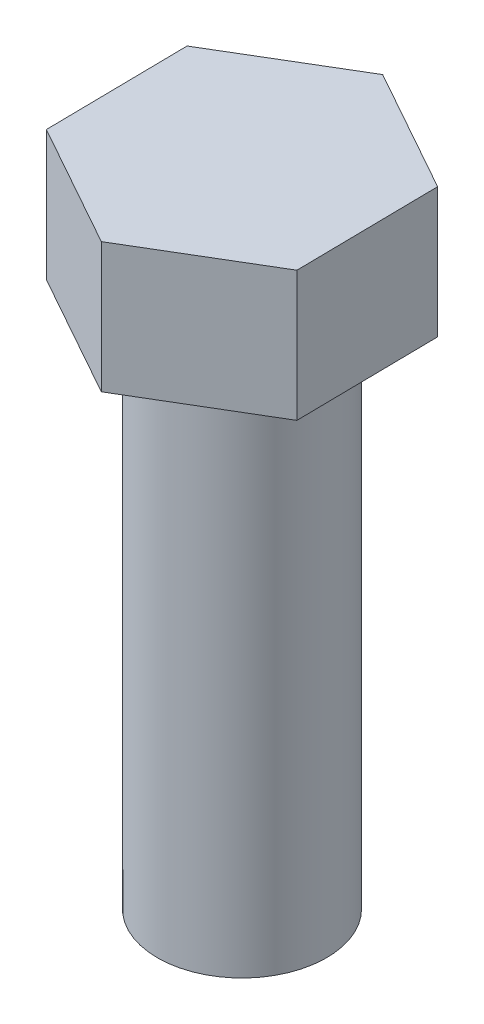
ISO-10303-21;
HEADER;
FILE_DESCRIPTION(('STEP AP214'),'2;1');
FILE_NAME('part.step','',(''),(''),'','','');
FILE_SCHEMA(('AUTOMOTIVE_DESIGN { 1 0 10303 214 1 1 1 1 }'));
ENDSEC;
DATA;
#1=APPLICATION_CONTEXT('core data for automotive mechanical design processes');
#2=APPLICATION_PROTOCOL_DEFINITION('international standard','automotive_design',2000,#1);
#3=PRODUCT_CONTEXT('',#1,'mechanical');
#4=PRODUCT('Part','Part','',(#3));
#5=PRODUCT_RELATED_PRODUCT_CATEGORY('part','',(#4));
#6=PRODUCT_DEFINITION_FORMATION('','',#4);
#7=PRODUCT_DEFINITION_CONTEXT('part definition',#1,'design');
#8=PRODUCT_DEFINITION('design','',#6,#7);
#9=PRODUCT_DEFINITION_SHAPE('','',#8);
#10=(LENGTH_UNIT() NAMED_UNIT(*) SI_UNIT(.MILLI.,.METRE.));
#11=(NAMED_UNIT(*) PLANE_ANGLE_UNIT() SI_UNIT($,.RADIAN.));
#12=(NAMED_UNIT(*) SI_UNIT($,.STERADIAN.) SOLID_ANGLE_UNIT());
#13=UNCERTAINTY_MEASURE_WITH_UNIT(LENGTH_MEASURE(1.E-05),#10,'distance_accuracy_value','');
#14=(GEOMETRIC_REPRESENTATION_CONTEXT(3) GLOBAL_UNCERTAINTY_ASSIGNED_CONTEXT((#13)) GLOBAL_UNIT_ASSIGNED_CONTEXT((#10,
#11,#12)) REPRESENTATION_CONTEXT('',''));
#15=CARTESIAN_POINT('',(0.,0.,0.));
#16=DIRECTION('',(0.,0.,1.));
#17=DIRECTION('',(1.,0.,0.));
#18=AXIS2_PLACEMENT_3D('',#15,#16,#17);
#19=CARTESIAN_POINT('',(0.,40.,0.));
#20=DIRECTION('',(0.,-1.,0.));
#21=DIRECTION('',(0.,0.,-1.));
#22=AXIS2_PLACEMENT_3D('',#19,#20,#21);
#23=CYLINDRICAL_SURFACE('',#22,6.5);
#24=CARTESIAN_POINT('',(0.,40.,0.));
#25=DIRECTION('',(0.,1.,0.));
#26=DIRECTION('',(0.,0.,1.));
#27=AXIS2_PLACEMENT_3D('',#24,#25,#26);
#28=CIRCLE('',#27,6.5);
#29=CARTESIAN_POINT('',(0.,40.,6.5));
#30=VERTEX_POINT('',#29);
#31=EDGE_CURVE('E11',#30,#30,#28,.T.);
#32=ORIENTED_EDGE('',*,*,#31,.F.);
#33=EDGE_LOOP('',(#32));
#34=FACE_BOUND('',#33,.T.);
#35=CARTESIAN_POINT('',(0.,0.,0.));
#36=DIRECTION('',(0.,1.,0.));
#37=DIRECTION('',(0.,0.,1.));
#38=AXIS2_PLACEMENT_3D('',#35,#36,#37);
#39=CIRCLE('',#38,6.5);
#40=CARTESIAN_POINT('',(0.,0.,6.5));
#41=VERTEX_POINT('',#40);
#42=EDGE_CURVE('E36',#41,#41,#39,.T.);
#43=ORIENTED_EDGE('',*,*,#42,.T.);
#44=EDGE_LOOP('',(#43));
#45=FACE_BOUND('',#44,.T.);
#46=ADVANCED_FACE('F33',(#34,#45),#23,.T.);
#47=CARTESIAN_POINT('',(0.,0.,0.));
#48=DIRECTION('',(0.,1.,0.));
#49=DIRECTION('',(0.,0.,1.));
#50=AXIS2_PLACEMENT_3D('',#47,#48,#49);
#51=PLANE('',#50);
#52=ORIENTED_EDGE('',*,*,#42,.F.);
#53=EDGE_LOOP('',(#52));
#54=FACE_BOUND('',#53,.T.);
#55=ADVANCED_FACE('F141',(#54),#51,.F.);
#56=CARTESIAN_POINT('',(0.,40.,0.));
#57=DIRECTION('',(0.,1.,0.));
#58=DIRECTION('',(0.,0.,1.));
#59=AXIS2_PLACEMENT_3D('',#56,#57,#58);
#60=PLANE('',#59);
#61=DIRECTION('',(-0.858970406477743,0.,0.51202523452996));
#62=VECTOR('',#61,1.);
#63=CARTESIAN_POINT('',(-0.152935171679067,40.,-10.9685889779222));
#64=LINE('',#63,#62);
#65=CARTESIAN_POINT('',(-0.152935171679067,40.,-10.9685889779222));
#66=VERTEX_POINT('',#65);
#67=CARTESIAN_POINT('',(-9.57554428439017,40.,-5.3518487451549));
#68=VERTEX_POINT('',#67);
#69=EDGE_CURVE('E118',#66,#68,#64,.T.);
#70=ORIENTED_EDGE('',*,*,#69,.F.);
#71=DIRECTION('',(-0.872912063720502,0.,-0.487877575843791));
#72=VECTOR('',#71,1.);
#73=CARTESIAN_POINT('',(9.4226091127111,40.,-5.61674023276733));
#74=LINE('',#73,#72);
#75=CARTESIAN_POINT('',(9.4226091127111,40.,-5.61674023276733));
#76=VERTEX_POINT('',#75);
#77=EDGE_CURVE('E78',#76,#66,#74,.T.);
#78=ORIENTED_EDGE('',*,*,#77,.F.);
#79=DIRECTION('',(-0.0139416572427592,0.,-0.999902810373751));
#80=VECTOR('',#79,1.);
#81=CARTESIAN_POINT('',(9.57554428439017,40.,5.3518487451549));
#82=LINE('',#81,#80);
#83=CARTESIAN_POINT('',(9.57554428439017,40.,5.3518487451549));
#84=VERTEX_POINT('',#83);
#85=EDGE_CURVE('E72',#84,#76,#82,.T.);
#86=ORIENTED_EDGE('',*,*,#85,.F.);
#87=DIRECTION('',(0.858970406477743,0.,-0.51202523452996));
#88=VECTOR('',#87,1.);
#89=CARTESIAN_POINT('',(0.152935171679067,40.,10.9685889779222));
#90=LINE('',#89,#88);
#91=CARTESIAN_POINT('',(0.152935171679067,40.,10.9685889779222));
#92=VERTEX_POINT('',#91);
#93=EDGE_CURVE('E108',#92,#84,#90,.T.);
#94=ORIENTED_EDGE('',*,*,#93,.F.);
#95=DIRECTION('',(0.872912063720502,0.,0.487877575843791));
#96=VECTOR('',#95,1.);
#97=CARTESIAN_POINT('',(-9.42260911271111,40.,5.61674023276732));
#98=LINE('',#97,#96);
#99=CARTESIAN_POINT('',(-9.42260911271111,40.,5.61674023276732));
#100=VERTEX_POINT('',#99);
#101=EDGE_CURVE('E123',#100,#92,#98,.T.);
#102=ORIENTED_EDGE('',*,*,#101,.F.);
#103=DIRECTION('',(0.0139416572427585,0.,0.999902810373751));
#104=VECTOR('',#103,1.);
#105=CARTESIAN_POINT('',(-9.57554428439017,40.,-5.3518487451549));
#106=LINE('',#105,#104);
#107=EDGE_CURVE('E121',#68,#100,#106,.T.);
#108=ORIENTED_EDGE('',*,*,#107,.F.);
#109=EDGE_LOOP('',(#70,#78,#86,#94,#102,#108));
#110=FACE_BOUND('',#109,.T.);
#111=ORIENTED_EDGE('',*,*,#31,.T.);
#112=EDGE_LOOP('',(#111));
#113=FACE_BOUND('',#112,.T.);
#114=ADVANCED_FACE('F143',(#110,#113),#60,.F.);
#115=CARTESIAN_POINT('',(-0.152935171679067,50.,-10.9685889779222));
#116=DIRECTION('',(0.51202523452996,0.,0.858970406477743));
#117=DIRECTION('',(0.858970406477743,0.,-0.51202523452996));
#118=AXIS2_PLACEMENT_3D('',#115,#116,#117);
#119=PLANE('',#118);
#120=ORIENTED_EDGE('',*,*,#69,.T.);
#121=DIRECTION('',(0.,-1.,0.));
#122=VECTOR('',#121,1.);
#123=CARTESIAN_POINT('',(-9.57554428439017,50.,-5.3518487451549));
#124=LINE('',#123,#122);
#125=CARTESIAN_POINT('',(-9.57554428439017,50.,-5.3518487451549));
#126=VERTEX_POINT('',#125);
#127=EDGE_CURVE('E135',#126,#68,#124,.T.);
#128=ORIENTED_EDGE('',*,*,#127,.F.);
#129=DIRECTION('',(-0.858970406477743,0.,0.51202523452996));
#130=VECTOR('',#129,1.);
#131=CARTESIAN_POINT('',(-0.152935171679067,50.,-10.9685889779222));
#132=LINE('',#131,#130);
#133=CARTESIAN_POINT('',(-0.152935171679067,50.,-10.9685889779222));
#134=VERTEX_POINT('',#133);
#135=EDGE_CURVE('E128',#134,#126,#132,.T.);
#136=ORIENTED_EDGE('',*,*,#135,.F.);
#137=DIRECTION('',(0.,-1.,0.));
#138=VECTOR('',#137,1.);
#139=CARTESIAN_POINT('',(-0.152935171679067,50.,-10.9685889779222));
#140=LINE('',#139,#138);
#141=EDGE_CURVE('E114',#134,#66,#140,.T.);
#142=ORIENTED_EDGE('',*,*,#141,.T.);
#143=EDGE_LOOP('',(#120,#128,#136,#142));
#144=FACE_BOUND('',#143,.T.);
#145=ADVANCED_FACE('F148',(#144),#119,.F.);
#146=CARTESIAN_POINT('',(-9.57554428439017,50.,-5.3518487451549));
#147=DIRECTION('',(0.999902810373751,0.,-0.0139416572427585));
#148=DIRECTION('',(-0.0139416572427585,0.,-0.999902810373751));
#149=AXIS2_PLACEMENT_3D('',#146,#147,#148);
#150=PLANE('',#149);
#151=ORIENTED_EDGE('',*,*,#107,.T.);
#152=DIRECTION('',(0.,-1.,0.));
#153=VECTOR('',#152,1.);
#154=CARTESIAN_POINT('',(-9.42260911271111,50.,5.61674023276732));
#155=LINE('',#154,#153);
#156=CARTESIAN_POINT('',(-9.42260911271111,50.,5.61674023276732));
#157=VERTEX_POINT('',#156);
#158=EDGE_CURVE('E132',#157,#100,#155,.T.);
#159=ORIENTED_EDGE('',*,*,#158,.F.);
#160=DIRECTION('',(0.0139416572427585,0.,0.999902810373751));
#161=VECTOR('',#160,1.);
#162=CARTESIAN_POINT('',(-9.57554428439017,50.,-5.3518487451549));
#163=LINE('',#162,#161);
#164=EDGE_CURVE('E87',#126,#157,#163,.T.);
#165=ORIENTED_EDGE('',*,*,#164,.F.);
#166=ORIENTED_EDGE('',*,*,#127,.T.);
#167=EDGE_LOOP('',(#151,#159,#165,#166));
#168=FACE_BOUND('',#167,.T.);
#169=ADVANCED_FACE('F155',(#168),#150,.F.);
#170=CARTESIAN_POINT('',(-9.42260911271111,50.,5.61674023276732));
#171=DIRECTION('',(0.487877575843791,0.,-0.872912063720502));
#172=DIRECTION('',(-0.872912063720502,0.,-0.487877575843791));
#173=AXIS2_PLACEMENT_3D('',#170,#171,#172);
#174=PLANE('',#173);
#175=ORIENTED_EDGE('',*,*,#101,.T.);
#176=DIRECTION('',(0.,-1.,0.));
#177=VECTOR('',#176,1.);
#178=CARTESIAN_POINT('',(0.152935171679067,50.,10.9685889779222));
#179=LINE('',#178,#177);
#180=CARTESIAN_POINT('',(0.152935171679067,50.,10.9685889779222));
#181=VERTEX_POINT('',#180);
#182=EDGE_CURVE('E109',#181,#92,#179,.T.);
#183=ORIENTED_EDGE('',*,*,#182,.F.);
#184=DIRECTION('',(0.872912063720502,0.,0.487877575843791));
#185=VECTOR('',#184,1.);
#186=CARTESIAN_POINT('',(-9.42260911271111,50.,5.61674023276732));
#187=LINE('',#186,#185);
#188=EDGE_CURVE('E100',#157,#181,#187,.T.);
#189=ORIENTED_EDGE('',*,*,#188,.F.);
#190=ORIENTED_EDGE('',*,*,#158,.T.);
#191=EDGE_LOOP('',(#175,#183,#189,#190));
#192=FACE_BOUND('',#191,.T.);
#193=ADVANCED_FACE('F159',(#192),#174,.F.);
#194=CARTESIAN_POINT('',(0.152935171679067,50.,10.9685889779222));
#195=DIRECTION('',(-0.51202523452996,0.,-0.858970406477743));
#196=DIRECTION('',(-0.858970406477743,0.,0.51202523452996));
#197=AXIS2_PLACEMENT_3D('',#194,#195,#196);
#198=PLANE('',#197);
#199=ORIENTED_EDGE('',*,*,#93,.T.);
#200=DIRECTION('',(0.,-1.,0.));
#201=VECTOR('',#200,1.);
#202=CARTESIAN_POINT('',(9.57554428439017,50.,5.3518487451549));
#203=LINE('',#202,#201);
#204=CARTESIAN_POINT('',(9.57554428439017,50.,5.3518487451549));
#205=VERTEX_POINT('',#204);
#206=EDGE_CURVE('E105',#205,#84,#203,.T.);
#207=ORIENTED_EDGE('',*,*,#206,.F.);
#208=DIRECTION('',(0.858970406477743,0.,-0.51202523452996));
#209=VECTOR('',#208,1.);
#210=CARTESIAN_POINT('',(0.152935171679067,50.,10.9685889779222));
#211=LINE('',#210,#209);
#212=EDGE_CURVE('E94',#181,#205,#211,.T.);
#213=ORIENTED_EDGE('',*,*,#212,.F.);
#214=ORIENTED_EDGE('',*,*,#182,.T.);
#215=EDGE_LOOP('',(#199,#207,#213,#214));
#216=FACE_BOUND('',#215,.T.);
#217=ADVANCED_FACE('F106',(#216),#198,.F.);
#218=CARTESIAN_POINT('',(9.57554428439017,50.,5.3518487451549));
#219=DIRECTION('',(-0.999902810373751,0.,0.0139416572427592));
#220=DIRECTION('',(0.0139416572427592,0.,0.999902810373751));
#221=AXIS2_PLACEMENT_3D('',#218,#219,#220);
#222=PLANE('',#221);
#223=ORIENTED_EDGE('',*,*,#85,.T.);
#224=DIRECTION('',(0.,-1.,0.));
#225=VECTOR('',#224,1.);
#226=CARTESIAN_POINT('',(9.4226091127111,50.,-5.61674023276733));
#227=LINE('',#226,#225);
#228=CARTESIAN_POINT('',(9.4226091127111,50.,-5.61674023276733));
#229=VERTEX_POINT('',#228);
#230=EDGE_CURVE('E110',#229,#76,#227,.T.);
#231=ORIENTED_EDGE('',*,*,#230,.F.);
#232=DIRECTION('',(-0.0139416572427592,0.,-0.999902810373751));
#233=VECTOR('',#232,1.);
#234=CARTESIAN_POINT('',(9.57554428439017,50.,5.3518487451549));
#235=LINE('',#234,#233);
#236=EDGE_CURVE('E98',#205,#229,#235,.T.);
#237=ORIENTED_EDGE('',*,*,#236,.F.);
#238=ORIENTED_EDGE('',*,*,#206,.T.);
#239=EDGE_LOOP('',(#223,#231,#237,#238));
#240=FACE_BOUND('',#239,.T.);
#241=ADVANCED_FACE('F112',(#240),#222,.F.);
#242=CARTESIAN_POINT('',(9.4226091127111,50.,-5.61674023276733));
#243=DIRECTION('',(-0.487877575843791,0.,0.872912063720502));
#244=DIRECTION('',(0.872912063720502,0.,0.487877575843791));
#245=AXIS2_PLACEMENT_3D('',#242,#243,#244);
#246=PLANE('',#245);
#247=ORIENTED_EDGE('',*,*,#77,.T.);
#248=ORIENTED_EDGE('',*,*,#141,.F.);
#249=DIRECTION('',(-0.872912063720502,0.,-0.487877575843791));
#250=VECTOR('',#249,1.);
#251=CARTESIAN_POINT('',(9.4226091127111,50.,-5.61674023276733));
#252=LINE('',#251,#250);
#253=EDGE_CURVE('E49',#229,#134,#252,.T.);
#254=ORIENTED_EDGE('',*,*,#253,.F.);
#255=ORIENTED_EDGE('',*,*,#230,.T.);
#256=EDGE_LOOP('',(#247,#248,#254,#255));
#257=FACE_BOUND('',#256,.T.);
#258=ADVANCED_FACE('F167',(#257),#246,.F.);
#259=CARTESIAN_POINT('',(0.,50.,0.));
#260=DIRECTION('',(0.,1.,0.));
#261=DIRECTION('',(0.,0.,1.));
#262=AXIS2_PLACEMENT_3D('',#259,#260,#261);
#263=PLANE('',#262);
#264=ORIENTED_EDGE('',*,*,#135,.T.);
#265=ORIENTED_EDGE('',*,*,#164,.T.);
#266=ORIENTED_EDGE('',*,*,#188,.T.);
#267=ORIENTED_EDGE('',*,*,#212,.T.);
#268=ORIENTED_EDGE('',*,*,#236,.T.);
#269=ORIENTED_EDGE('',*,*,#253,.T.);
#270=EDGE_LOOP('',(#264,#265,#266,#267,#268,#269));
#271=FACE_BOUND('',#270,.T.);
#272=ADVANCED_FACE('F96',(#271),#263,.T.);
#273=CLOSED_SHELL('',(#46,#55,#114,#145,#169,#193,#217,#241,#258,#272));
#274=MANIFOLD_SOLID_BREP('B2',#273);
#275=ADVANCED_BREP_SHAPE_REPRESENTATION('',(#18,#274),#14);
#276=SHAPE_DEFINITION_REPRESENTATION(#9,#275);
ENDSEC;
END-ISO-10303-21;
